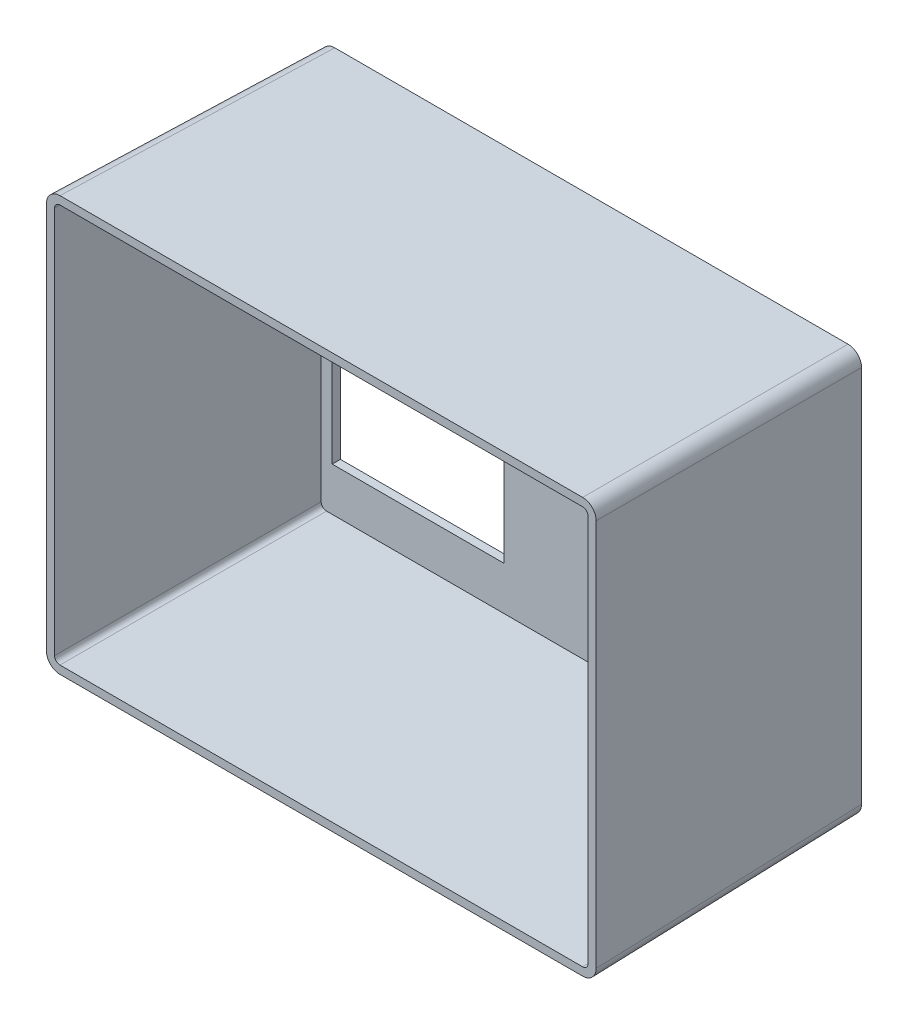
ISO-10303-21;
HEADER;
FILE_DESCRIPTION(('STEP AP214'),'2;1');
FILE_NAME('part.step','',(''),(''),'','','');
FILE_SCHEMA(('AUTOMOTIVE_DESIGN { 1 0 10303 214 1 1 1 1 }'));
ENDSEC;
DATA;
#1=APPLICATION_CONTEXT('core data for automotive mechanical design processes');
#2=APPLICATION_PROTOCOL_DEFINITION('international standard','automotive_design',2000,#1);
#3=PRODUCT_CONTEXT('',#1,'mechanical');
#4=PRODUCT('Part','Part','',(#3));
#5=PRODUCT_RELATED_PRODUCT_CATEGORY('part','',(#4));
#6=PRODUCT_DEFINITION_FORMATION('','',#4);
#7=PRODUCT_DEFINITION_CONTEXT('part definition',#1,'design');
#8=PRODUCT_DEFINITION('design','',#6,#7);
#9=PRODUCT_DEFINITION_SHAPE('','',#8);
#10=(LENGTH_UNIT() NAMED_UNIT(*) SI_UNIT(.MILLI.,.METRE.));
#11=(NAMED_UNIT(*) PLANE_ANGLE_UNIT() SI_UNIT($,.RADIAN.));
#12=(NAMED_UNIT(*) SI_UNIT($,.STERADIAN.) SOLID_ANGLE_UNIT());
#13=UNCERTAINTY_MEASURE_WITH_UNIT(LENGTH_MEASURE(1.E-05),#10,'distance_accuracy_value','');
#14=(GEOMETRIC_REPRESENTATION_CONTEXT(3) GLOBAL_UNCERTAINTY_ASSIGNED_CONTEXT((#13)) GLOBAL_UNIT_ASSIGNED_CONTEXT((#10,
#11,#12)) REPRESENTATION_CONTEXT('',''));
#15=CARTESIAN_POINT('',(0.,0.,0.));
#16=DIRECTION('',(0.,0.,1.));
#17=DIRECTION('',(1.,0.,0.));
#18=AXIS2_PLACEMENT_3D('',#15,#16,#17);
#19=CARTESIAN_POINT('',(71.0730699258488,138.110328622126,0.));
#20=DIRECTION('',(0.999847695156391,0.,-0.0174524064372835));
#21=DIRECTION('',(-0.0174524064372835,0.,-0.999847695156391));
#22=AXIS2_PLACEMENT_3D('',#19,#20,#21);
#23=PLANE('',#22);
#24=DIRECTION('',(0.,-1.,0.));
#25=VECTOR('',#24,1.);
#26=CARTESIAN_POINT('',(72.8185764186705,138.110328622126,100.));
#27=LINE('',#26,#25);
#28=CARTESIAN_POINT('',(72.8185764186706,-8.63593939491358,100.));
#29=VERTEX_POINT('',#28);
#30=CARTESIAN_POINT('',(72.8185764186705,134.856596639166,100.));
#31=VERTEX_POINT('',#30);
#32=EDGE_CURVE('E363',#29,#31,#27,.F.);
#33=ORIENTED_EDGE('',*,*,#32,.F.);
#34=DIRECTION('',(0.0174497491606827,-0.0174497491606827,0.999695459881887));
#35=VECTOR('',#34,1.);
#36=CARTESIAN_POINT('',(71.0289181008327,-6.84628107707569,-2.52945636110152));
#37=LINE('',#36,#35);
#38=CARTESIAN_POINT('',(71.0730699258488,-6.89043290209182,0.));
#39=VERTEX_POINT('',#38);
#40=EDGE_CURVE('E403',#29,#39,#37,.F.);
#41=ORIENTED_EDGE('',*,*,#40,.T.);
#42=DIRECTION('',(0.,1.,0.));
#43=VECTOR('',#42,1.);
#44=CARTESIAN_POINT('',(71.0730699258488,138.110328622126,0.));
#45=LINE('',#44,#43);
#46=CARTESIAN_POINT('',(71.0730699258488,133.111090146344,0.));
#47=VERTEX_POINT('',#46);
#48=EDGE_CURVE('E324',#39,#47,#45,.T.);
#49=ORIENTED_EDGE('',*,*,#48,.T.);
#50=DIRECTION('',(0.0174497491606827,0.0174497491606827,0.999695459881888));
#51=VECTOR('',#50,1.);
#52=CARTESIAN_POINT('',(71.0745921626983,133.112612383194,0.0872088907003298));
#53=LINE('',#52,#51);
#54=EDGE_CURVE('E401',#47,#31,#53,.T.);
#55=ORIENTED_EDGE('',*,*,#54,.T.);
#56=EDGE_LOOP('',(#33,#41,#49,#55));
#57=FACE_BOUND('',#56,.T.);
#58=ADVANCED_FACE('F39',(#57),#23,.T.);
#59=CARTESIAN_POINT('',(-128.926930074151,138.110328622126,0.));
#60=DIRECTION('',(0.,0.999847695156391,-0.0174524064372835));
#61=DIRECTION('',(0.,0.0174524064372835,0.999847695156391));
#62=AXIS2_PLACEMENT_3D('',#59,#60,#61);
#63=PLANE('',#62);
#64=DIRECTION('',(-1.,0.,0.));
#65=VECTOR('',#64,1.);
#66=CARTESIAN_POINT('',(-128.926930074151,138.110328622126,0.));
#67=LINE('',#66,#65);
#68=CARTESIAN_POINT('',(66.0738314500668,138.110328622126,0.));
#69=VERTEX_POINT('',#68);
#70=CARTESIAN_POINT('',(-123.927691598369,138.110328622126,0.));
#71=VERTEX_POINT('',#70);
#72=EDGE_CURVE('E354',#69,#71,#67,.T.);
#73=ORIENTED_EDGE('',*,*,#72,.T.);
#74=DIRECTION('',(-0.0174497491606827,0.0174497491606827,0.999695459881888));
#75=VECTOR('',#74,1.);
#76=CARTESIAN_POINT('',(-123.929213835219,138.111850858976,0.0872088907003298));
#77=LINE('',#76,#75);
#78=CARTESIAN_POINT('',(-125.673198091191,139.855835114948,100.));
#79=VERTEX_POINT('',#78);
#80=EDGE_CURVE('E409',#71,#79,#77,.T.);
#81=ORIENTED_EDGE('',*,*,#80,.T.);
#82=DIRECTION('',(1.,0.,0.));
#83=VECTOR('',#82,1.);
#84=CARTESIAN_POINT('',(-128.926930074151,139.855835114948,100.));
#85=LINE('',#84,#83);
#86=CARTESIAN_POINT('',(67.8193379428886,139.855835114948,100.));
#87=VERTEX_POINT('',#86);
#88=EDGE_CURVE('E366',#87,#79,#85,.F.);
#89=ORIENTED_EDGE('',*,*,#88,.F.);
#90=DIRECTION('',(0.0174497491606827,0.0174497491606827,0.999695459881888));
#91=VECTOR('',#90,1.);
#92=CARTESIAN_POINT('',(66.0144549377621,138.050952109822,-3.40167811170213));
#93=LINE('',#92,#91);
#94=EDGE_CURVE('E406',#87,#69,#93,.F.);
#95=ORIENTED_EDGE('',*,*,#94,.T.);
#96=EDGE_LOOP('',(#73,#81,#89,#95));
#97=FACE_BOUND('',#96,.T.);
#98=ADVANCED_FACE('F453',(#97),#63,.T.);
#99=CARTESIAN_POINT('',(-128.926930074151,138.110328622126,0.));
#100=DIRECTION('',(-0.999847695156391,0.,-0.0174524064372835));
#101=DIRECTION('',(-0.0174524064372835,0.,0.999847695156391));
#102=AXIS2_PLACEMENT_3D('',#99,#100,#101);
#103=PLANE('',#102);
#104=DIRECTION('',(0.,-1.,0.));
#105=VECTOR('',#104,1.);
#106=CARTESIAN_POINT('',(-128.926930074151,138.110328622126,0.));
#107=LINE('',#106,#105);
#108=CARTESIAN_POINT('',(-128.926930074151,133.111090146344,0.));
#109=VERTEX_POINT('',#108);
#110=CARTESIAN_POINT('',(-128.926930074151,-6.89043290209182,0.));
#111=VERTEX_POINT('',#110);
#112=EDGE_CURVE('E357',#109,#111,#107,.T.);
#113=ORIENTED_EDGE('',*,*,#112,.T.);
#114=DIRECTION('',(-0.0174497491606827,-0.0174497491606827,0.999695459881887));
#115=VECTOR('',#114,1.);
#116=CARTESIAN_POINT('',(-128.882778249135,-6.84628107707569,-2.52945636110151));
#117=LINE('',#116,#115);
#118=CARTESIAN_POINT('',(-130.672436566973,-8.63593939491358,100.));
#119=VERTEX_POINT('',#118);
#120=EDGE_CURVE('E391',#111,#119,#117,.T.);
#121=ORIENTED_EDGE('',*,*,#120,.T.);
#122=DIRECTION('',(0.,1.,0.));
#123=VECTOR('',#122,1.);
#124=CARTESIAN_POINT('',(-130.672436566973,138.110328622126,100.));
#125=LINE('',#124,#123);
#126=CARTESIAN_POINT('',(-130.672436566973,134.856596639166,100.));
#127=VERTEX_POINT('',#126);
#128=EDGE_CURVE('E369',#127,#119,#125,.F.);
#129=ORIENTED_EDGE('',*,*,#128,.F.);
#130=DIRECTION('',(-0.0174497491606827,0.0174497491606827,0.999695459881888));
#131=VECTOR('',#130,1.);
#132=CARTESIAN_POINT('',(-128.928452311001,133.112612383194,0.0872088907003298));
#133=LINE('',#132,#131);
#134=EDGE_CURVE('E388',#127,#109,#133,.F.);
#135=ORIENTED_EDGE('',*,*,#134,.T.);
#136=EDGE_LOOP('',(#113,#121,#129,#135));
#137=FACE_BOUND('',#136,.T.);
#138=ADVANCED_FACE('F459',(#137),#103,.T.);
#139=CARTESIAN_POINT('',(-128.926930074151,-11.8896713778738,0.));
#140=DIRECTION('',(0.,-0.999847695156391,-0.0174524064372835));
#141=DIRECTION('',(0.,0.0174524064372836,-0.999847695156391));
#142=AXIS2_PLACEMENT_3D('',#139,#140,#141);
#143=PLANE('',#142);
#144=DIRECTION('',(-1.,0.,0.));
#145=VECTOR('',#144,1.);
#146=CARTESIAN_POINT('',(-128.926930074151,-13.6351778706955,100.));
#147=LINE('',#146,#145);
#148=CARTESIAN_POINT('',(-125.673198091191,-13.6351778706955,100.));
#149=VERTEX_POINT('',#148);
#150=CARTESIAN_POINT('',(67.8193379428886,-13.6351778706955,100.));
#151=VERTEX_POINT('',#150);
#152=EDGE_CURVE('E372',#149,#151,#147,.F.);
#153=ORIENTED_EDGE('',*,*,#152,.F.);
#154=DIRECTION('',(-0.0174497491606827,-0.0174497491606827,0.999695459881888));
#155=VECTOR('',#154,1.);
#156=CARTESIAN_POINT('',(-123.929213835219,-11.8911936147233,0.0872088907003298));
#157=LINE('',#156,#155);
#158=CARTESIAN_POINT('',(-123.927691598369,-11.8896713778738,0.));
#159=VERTEX_POINT('',#158);
#160=EDGE_CURVE('E377',#149,#159,#157,.F.);
#161=ORIENTED_EDGE('',*,*,#160,.T.);
#162=DIRECTION('',(1.,0.,0.));
#163=VECTOR('',#162,1.);
#164=CARTESIAN_POINT('',(-128.926930074151,-11.8896713778738,0.));
#165=LINE('',#164,#163);
#166=CARTESIAN_POINT('',(66.0738314500668,-11.8896713778738,0.));
#167=VERTEX_POINT('',#166);
#168=EDGE_CURVE('E360',#159,#167,#165,.T.);
#169=ORIENTED_EDGE('',*,*,#168,.T.);
#170=DIRECTION('',(0.0174497491606827,-0.0174497491606827,0.999695459881888));
#171=VECTOR('',#170,1.);
#172=CARTESIAN_POINT('',(66.0144549377621,-11.8302948655691,-3.40167811170213));
#173=LINE('',#172,#171);
#174=EDGE_CURVE('E375',#167,#151,#173,.T.);
#175=ORIENTED_EDGE('',*,*,#174,.T.);
#176=EDGE_LOOP('',(#153,#161,#169,#175));
#177=FACE_BOUND('',#176,.T.);
#178=ADVANCED_FACE('F466',(#177),#143,.T.);
#179=CARTESIAN_POINT('',(0.,0.,100.));
#180=DIRECTION('',(0.,0.,1.));
#181=DIRECTION('',(1.,0.,0.));
#182=AXIS2_PLACEMENT_3D('',#179,#180,#181);
#183=PLANE('',#182);
#184=DIRECTION('',(0.,1.,0.));
#185=VECTOR('',#184,1.);
#186=CARTESIAN_POINT('',(-127.671979582841,138.110328622126,100.));
#187=LINE('',#186,#185);
#188=CARTESIAN_POINT('',(-127.671979582841,134.855682740503,100.));
#189=VERTEX_POINT('',#188);
#190=CARTESIAN_POINT('',(-127.671979582841,-8.63502549625103,100.));
#191=VERTEX_POINT('',#190);
#192=EDGE_CURVE('E343',#189,#191,#187,.F.);
#193=ORIENTED_EDGE('',*,*,#192,.F.);
#194=CARTESIAN_POINT('',(-125.671674926753,134.855073474728,100.));
#195=DIRECTION('',(0.,0.,1.));
#196=DIRECTION('',(0.707106781186548,-0.707106781186547,0.));
#197=AXIS2_PLACEMENT_3D('',#194,#195,#196);
#198=ELLIPSE('',#197,2.0006092657821,2.);
#199=CARTESIAN_POINT('',(-125.672284192528,136.855378130816,100.));
#200=VERTEX_POINT('',#199);
#201=EDGE_CURVE('E341',#200,#189,#198,.T.);
#202=ORIENTED_EDGE('',*,*,#201,.F.);
#203=DIRECTION('',(1.,0.,0.));
#204=VECTOR('',#203,1.);
#205=CARTESIAN_POINT('',(-128.926930074151,136.855378130816,100.));
#206=LINE('',#205,#204);
#207=CARTESIAN_POINT('',(67.818424044226,136.855378130816,100.));
#208=VERTEX_POINT('',#207);
#209=EDGE_CURVE('E339',#208,#200,#206,.F.);
#210=ORIENTED_EDGE('',*,*,#209,.F.);
#211=CARTESIAN_POINT('',(67.817814778451,134.855073474728,100.));
#212=DIRECTION('',(0.,0.,1.));
#213=DIRECTION('',(-0.707106781186547,-0.707106781186548,0.));
#214=AXIS2_PLACEMENT_3D('',#211,#212,#213);
#215=ELLIPSE('',#214,2.0006092657821,2.);
#216=CARTESIAN_POINT('',(69.8181194345388,134.855682740503,100.));
#217=VERTEX_POINT('',#216);
#218=EDGE_CURVE('E331',#217,#208,#215,.T.);
#219=ORIENTED_EDGE('',*,*,#218,.F.);
#220=DIRECTION('',(0.,-1.,0.));
#221=VECTOR('',#220,1.);
#222=CARTESIAN_POINT('',(69.8181194345388,138.110328622126,100.));
#223=LINE('',#222,#221);
#224=CARTESIAN_POINT('',(69.8181194345388,-8.63502549625102,100.));
#225=VERTEX_POINT('',#224);
#226=EDGE_CURVE('E305',#225,#217,#223,.F.);
#227=ORIENTED_EDGE('',*,*,#226,.F.);
#228=CARTESIAN_POINT('',(67.817814778451,-8.63441623047599,100.));
#229=DIRECTION('',(0.,0.,1.));
#230=DIRECTION('',(-0.707106781186548,0.707106781186547,0.));
#231=AXIS2_PLACEMENT_3D('',#228,#229,#230);
#232=ELLIPSE('',#231,2.0006092657821,2.);
#233=CARTESIAN_POINT('',(67.818424044226,-10.6347208865638,100.));
#234=VERTEX_POINT('',#233);
#235=EDGE_CURVE('E345',#234,#225,#232,.T.);
#236=ORIENTED_EDGE('',*,*,#235,.F.);
#237=DIRECTION('',(-1.,0.,0.));
#238=VECTOR('',#237,1.);
#239=CARTESIAN_POINT('',(-128.926930074151,-10.6347208865638,100.));
#240=LINE('',#239,#238);
#241=CARTESIAN_POINT('',(-125.672284192528,-10.6347208865638,100.));
#242=VERTEX_POINT('',#241);
#243=EDGE_CURVE('E336',#242,#234,#240,.F.);
#244=ORIENTED_EDGE('',*,*,#243,.F.);
#245=CARTESIAN_POINT('',(-125.671674926753,-8.634416230476,100.));
#246=DIRECTION('',(0.,0.,1.));
#247=DIRECTION('',(0.707106781186547,0.707106781186548,0.));
#248=AXIS2_PLACEMENT_3D('',#245,#246,#247);
#249=ELLIPSE('',#248,2.0006092657821,2.);
#250=EDGE_CURVE('E301',#191,#242,#249,.T.);
#251=ORIENTED_EDGE('',*,*,#250,.F.);
#252=EDGE_LOOP('',(#193,#202,#210,#219,#227,#236,#244,#251));
#253=FACE_BOUND('',#252,.T.);
#254=ORIENTED_EDGE('',*,*,#128,.T.);
#255=CARTESIAN_POINT('',(-125.671674926753,-8.634416230476,100.));
#256=DIRECTION('',(0.,0.,1.));
#257=DIRECTION('',(0.707106781186547,0.707106781186548,0.));
#258=AXIS2_PLACEMENT_3D('',#255,#256,#257);
#259=ELLIPSE('',#258,5.00152316445525,5.);
#260=EDGE_CURVE('E399',#119,#149,#259,.T.);
#261=ORIENTED_EDGE('',*,*,#260,.T.);
#262=ORIENTED_EDGE('',*,*,#152,.T.);
#263=CARTESIAN_POINT('',(67.817814778451,-8.63441623047599,100.));
#264=DIRECTION('',(0.,0.,1.));
#265=DIRECTION('',(-0.707106781186548,0.707106781186547,0.));
#266=AXIS2_PLACEMENT_3D('',#263,#264,#265);
#267=ELLIPSE('',#266,5.00152316445525,5.);
#268=EDGE_CURVE('E397',#151,#29,#267,.T.);
#269=ORIENTED_EDGE('',*,*,#268,.T.);
#270=ORIENTED_EDGE('',*,*,#32,.T.);
#271=CARTESIAN_POINT('',(67.817814778451,134.855073474728,100.));
#272=DIRECTION('',(0.,0.,1.));
#273=DIRECTION('',(-0.707106781186547,-0.707106781186548,0.));
#274=AXIS2_PLACEMENT_3D('',#271,#272,#273);
#275=ELLIPSE('',#274,5.00152316445525,5.);
#276=EDGE_CURVE('E393',#31,#87,#275,.T.);
#277=ORIENTED_EDGE('',*,*,#276,.T.);
#278=ORIENTED_EDGE('',*,*,#88,.T.);
#279=CARTESIAN_POINT('',(-125.671674926753,134.855073474728,100.));
#280=DIRECTION('',(0.,0.,1.));
#281=DIRECTION('',(0.707106781186548,-0.707106781186547,0.));
#282=AXIS2_PLACEMENT_3D('',#279,#280,#281);
#283=ELLIPSE('',#282,5.00152316445525,5.);
#284=EDGE_CURVE('E395',#79,#127,#283,.T.);
#285=ORIENTED_EDGE('',*,*,#284,.T.);
#286=EDGE_LOOP('',(#254,#261,#262,#269,#270,#277,#278,#285));
#287=FACE_BOUND('',#286,.T.);
#288=ADVANCED_FACE('F469',(#253,#287),#183,.T.);
#289=CARTESIAN_POINT('',(0.,0.,0.));
#290=DIRECTION('',(0.,0.,1.));
#291=DIRECTION('',(1.,0.,0.));
#292=AXIS2_PLACEMENT_3D('',#289,#290,#291);
#293=PLANE('',#292);
#294=DIRECTION('',(1.,0.,0.));
#295=VECTOR('',#294,1.);
#296=CARTESIAN_POINT('',(-58.3418365209024,45.3254204708937,0.));
#297=LINE('',#296,#295);
#298=CARTESIAN_POINT('',(-121.841836520902,45.3254204708937,0.));
#299=VERTEX_POINT('',#298);
#300=CARTESIAN_POINT('',(-58.3418365209024,45.3254204708937,0.));
#301=VERTEX_POINT('',#300);
#302=EDGE_CURVE('E235',#299,#301,#297,.T.);
#303=ORIENTED_EDGE('',*,*,#302,.F.);
#304=DIRECTION('',(0.,1.,0.));
#305=VECTOR('',#304,1.);
#306=CARTESIAN_POINT('',(-121.841836520902,45.3254204708937,0.));
#307=LINE('',#306,#305);
#308=CARTESIAN_POINT('',(-121.841836520902,7.22542047089366,0.));
#309=VERTEX_POINT('',#308);
#310=EDGE_CURVE('E54',#309,#299,#307,.T.);
#311=ORIENTED_EDGE('',*,*,#310,.F.);
#312=DIRECTION('',(-1.,0.,0.));
#313=VECTOR('',#312,1.);
#314=CARTESIAN_POINT('',(-58.3418365209024,7.22542047089366,0.));
#315=LINE('',#314,#313);
#316=CARTESIAN_POINT('',(-58.3418365209024,7.22542047089366,0.));
#317=VERTEX_POINT('',#316);
#318=EDGE_CURVE('E242',#317,#309,#315,.T.);
#319=ORIENTED_EDGE('',*,*,#318,.F.);
#320=DIRECTION('',(0.,-1.,0.));
#321=VECTOR('',#320,1.);
#322=CARTESIAN_POINT('',(-58.3418365209024,45.3254204708937,0.));
#323=LINE('',#322,#321);
#324=EDGE_CURVE('E226',#301,#317,#323,.T.);
#325=ORIENTED_EDGE('',*,*,#324,.F.);
#326=EDGE_LOOP('',(#303,#311,#319,#325));
#327=FACE_BOUND('',#326,.T.);
#328=DIRECTION('',(1.,0.,0.));
#329=VECTOR('',#328,1.);
#330=CARTESIAN_POINT('',(51.3314320632622,132.067467355582,0.));
#331=LINE('',#330,#329);
#332=CARTESIAN_POINT('',(31.3314320632622,132.067467355582,0.));
#333=VERTEX_POINT('',#332);
#334=CARTESIAN_POINT('',(51.3314320632622,132.067467355582,0.));
#335=VERTEX_POINT('',#334);
#336=EDGE_CURVE('E254',#333,#335,#331,.T.);
#337=ORIENTED_EDGE('',*,*,#336,.F.);
#338=DIRECTION('',(0.,1.,0.));
#339=VECTOR('',#338,1.);
#340=CARTESIAN_POINT('',(31.3314320632622,132.067467355582,0.));
#341=LINE('',#340,#339);
#342=CARTESIAN_POINT('',(31.3314320632622,106.667467355582,0.));
#343=VERTEX_POINT('',#342);
#344=EDGE_CURVE('E252',#343,#333,#341,.T.);
#345=ORIENTED_EDGE('',*,*,#344,.F.);
#346=DIRECTION('',(-1.,0.,0.));
#347=VECTOR('',#346,1.);
#348=CARTESIAN_POINT('',(51.3314320632622,106.667467355582,0.));
#349=LINE('',#348,#347);
#350=CARTESIAN_POINT('',(51.3314320632622,106.667467355582,0.));
#351=VERTEX_POINT('',#350);
#352=EDGE_CURVE('E261',#351,#343,#349,.T.);
#353=ORIENTED_EDGE('',*,*,#352,.F.);
#354=DIRECTION('',(0.,-1.,0.));
#355=VECTOR('',#354,1.);
#356=CARTESIAN_POINT('',(51.3314320632622,132.067467355582,0.));
#357=LINE('',#356,#355);
#358=EDGE_CURVE('E258',#335,#351,#357,.T.);
#359=ORIENTED_EDGE('',*,*,#358,.F.);
#360=EDGE_LOOP('',(#337,#345,#353,#359));
#361=FACE_BOUND('',#360,.T.);
#362=DIRECTION('',(1.,0.,0.));
#363=VECTOR('',#362,1.);
#364=CARTESIAN_POINT('',(63.8251783273508,17.6722086883321,0.));
#365=LINE('',#364,#363);
#366=CARTESIAN_POINT('',(13.8251783273508,17.6722086883321,0.));
#367=VERTEX_POINT('',#366);
#368=CARTESIAN_POINT('',(63.8251783273508,17.6722086883321,0.));
#369=VERTEX_POINT('',#368);
#370=EDGE_CURVE('E275',#367,#369,#365,.T.);
#371=ORIENTED_EDGE('',*,*,#370,.F.);
#372=DIRECTION('',(0.,1.,0.));
#373=VECTOR('',#372,1.);
#374=CARTESIAN_POINT('',(13.8251783273508,-2.32779131166794,0.));
#375=LINE('',#374,#373);
#376=CARTESIAN_POINT('',(13.8251783273508,-2.32779131166794,0.));
#377=VERTEX_POINT('',#376);
#378=EDGE_CURVE('E249',#377,#367,#375,.T.);
#379=ORIENTED_EDGE('',*,*,#378,.F.);
#380=DIRECTION('',(-1.,0.,0.));
#381=VECTOR('',#380,1.);
#382=CARTESIAN_POINT('',(63.8251783273508,-2.32779131166794,0.));
#383=LINE('',#382,#381);
#384=CARTESIAN_POINT('',(63.8251783273508,-2.32779131166794,0.));
#385=VERTEX_POINT('',#384);
#386=EDGE_CURVE('E281',#385,#377,#383,.T.);
#387=ORIENTED_EDGE('',*,*,#386,.F.);
#388=DIRECTION('',(0.,-1.,0.));
#389=VECTOR('',#388,1.);
#390=CARTESIAN_POINT('',(63.8251783273508,-2.32779131166794,0.));
#391=LINE('',#390,#389);
#392=EDGE_CURVE('E278',#369,#385,#391,.T.);
#393=ORIENTED_EDGE('',*,*,#392,.F.);
#394=EDGE_LOOP('',(#371,#379,#387,#393));
#395=FACE_BOUND('',#394,.T.);
#396=ORIENTED_EDGE('',*,*,#168,.F.);
#397=CARTESIAN_POINT('',(-123.926168433932,-6.88890973765424,0.));
#398=DIRECTION('',(0.,0.,1.));
#399=DIRECTION('',(0.707106781186547,0.707106781186548,0.));
#400=AXIS2_PLACEMENT_3D('',#397,#398,#399);
#401=ELLIPSE('',#400,5.00152316445525,5.);
#402=EDGE_CURVE('E386',#159,#111,#401,.F.);
#403=ORIENTED_EDGE('',*,*,#402,.T.);
#404=ORIENTED_EDGE('',*,*,#112,.F.);
#405=CARTESIAN_POINT('',(-123.926168433932,133.109566981907,0.));
#406=DIRECTION('',(0.,0.,1.));
#407=DIRECTION('',(0.707106781186548,-0.707106781186547,0.));
#408=AXIS2_PLACEMENT_3D('',#405,#406,#407);
#409=ELLIPSE('',#408,5.00152316445525,5.);
#410=EDGE_CURVE('E382',#109,#71,#409,.F.);
#411=ORIENTED_EDGE('',*,*,#410,.T.);
#412=ORIENTED_EDGE('',*,*,#72,.F.);
#413=CARTESIAN_POINT('',(66.0723082856292,133.109566981907,0.));
#414=DIRECTION('',(0.,0.,1.));
#415=DIRECTION('',(-0.707106781186547,-0.707106781186548,0.));
#416=AXIS2_PLACEMENT_3D('',#413,#414,#415);
#417=ELLIPSE('',#416,5.00152316445525,5.);
#418=EDGE_CURVE('E380',#69,#47,#417,.F.);
#419=ORIENTED_EDGE('',*,*,#418,.T.);
#420=ORIENTED_EDGE('',*,*,#48,.F.);
#421=CARTESIAN_POINT('',(66.0723082856293,-6.88890973765423,0.));
#422=DIRECTION('',(0.,0.,1.));
#423=DIRECTION('',(-0.707106781186548,0.707106781186547,0.));
#424=AXIS2_PLACEMENT_3D('',#421,#422,#423);
#425=ELLIPSE('',#424,5.00152316445525,5.);
#426=EDGE_CURVE('E384',#39,#167,#425,.F.);
#427=ORIENTED_EDGE('',*,*,#426,.T.);
#428=EDGE_LOOP('',(#396,#403,#404,#411,#412,#419,#420,#427));
#429=FACE_BOUND('',#428,.T.);
#430=ADVANCED_FACE('F239',(#327,#361,#395,#429),#293,.F.);
#431=CARTESIAN_POINT('',(-123.929213835219,-6.89195513894131,0.174470922886747));
#432=DIRECTION('',(0.0174497491606827,0.0174497491606827,-0.999695459881888));
#433=DIRECTION('',(0.,0.999847695156391,0.0174524064372836));
#434=AXIS2_PLACEMENT_3D('',#431,#432,#433);
#435=CYLINDRICAL_SURFACE('',#434,5.);
#436=ORIENTED_EDGE('',*,*,#260,.F.);
#437=ORIENTED_EDGE('',*,*,#120,.F.);
#438=ORIENTED_EDGE('',*,*,#402,.F.);
#439=ORIENTED_EDGE('',*,*,#160,.F.);
#440=EDGE_LOOP('',(#436,#437,#438,#439));
#441=FACE_BOUND('',#440,.T.);
#442=ADVANCED_FACE('F474',(#441),#435,.T.);
#443=CARTESIAN_POINT('',(66.0296796250507,-6.84628107707569,-2.4421943289151));
#444=DIRECTION('',(-0.0174497491606827,0.0174497491606827,-0.999695459881888));
#445=DIRECTION('',(-0.999847695156391,0.,0.0174524064372836));
#446=AXIS2_PLACEMENT_3D('',#443,#444,#445);
#447=CYLINDRICAL_SURFACE('',#446,5.);
#448=ORIENTED_EDGE('',*,*,#268,.F.);
#449=ORIENTED_EDGE('',*,*,#174,.F.);
#450=ORIENTED_EDGE('',*,*,#426,.F.);
#451=ORIENTED_EDGE('',*,*,#40,.F.);
#452=EDGE_LOOP('',(#448,#449,#450,#451));
#453=FACE_BOUND('',#452,.T.);
#454=ADVANCED_FACE('F477',(#453),#447,.T.);
#455=CARTESIAN_POINT('',(-123.929213835219,133.112612383194,0.174470922886748));
#456=DIRECTION('',(0.0174497491606827,-0.0174497491606827,-0.999695459881887));
#457=DIRECTION('',(-0.999847695156391,0.,-0.0174524064372836));
#458=AXIS2_PLACEMENT_3D('',#455,#456,#457);
#459=CYLINDRICAL_SURFACE('',#458,5.);
#460=ORIENTED_EDGE('',*,*,#284,.F.);
#461=ORIENTED_EDGE('',*,*,#80,.F.);
#462=ORIENTED_EDGE('',*,*,#410,.F.);
#463=ORIENTED_EDGE('',*,*,#134,.F.);
#464=EDGE_LOOP('',(#460,#461,#462,#463));
#465=FACE_BOUND('',#464,.T.);
#466=ADVANCED_FACE('F480',(#465),#459,.T.);
#467=CARTESIAN_POINT('',(66.0144549377621,133.05171363404,-3.31441607951571));
#468=DIRECTION('',(-0.0174497491606827,-0.0174497491606827,-0.999695459881887));
#469=DIRECTION('',(0.,0.999847695156391,-0.0174524064372835));
#470=AXIS2_PLACEMENT_3D('',#467,#468,#469);
#471=CYLINDRICAL_SURFACE('',#470,5.);
#472=ORIENTED_EDGE('',*,*,#276,.F.);
#473=ORIENTED_EDGE('',*,*,#54,.F.);
#474=ORIENTED_EDGE('',*,*,#418,.F.);
#475=ORIENTED_EDGE('',*,*,#94,.F.);
#476=EDGE_LOOP('',(#472,#473,#474,#475));
#477=FACE_BOUND('',#476,.T.);
#478=ADVANCED_FACE('F41',(#477),#471,.T.);
#479=CARTESIAN_POINT('',(68.0735268403796,138.110328622126,0.0523572193118506));
#480=DIRECTION('',(0.999847695156391,0.,-0.0174524064372835));
#481=DIRECTION('',(-0.0174524064372835,0.,-0.999847695156391));
#482=AXIS2_PLACEMENT_3D('',#479,#480,#481);
#483=PLANE('',#482);
#484=ORIENTED_EDGE('',*,*,#226,.T.);
#485=DIRECTION('',(-0.0174497491606827,-0.0174497491606827,-0.999695459881887));
#486=VECTOR('',#485,1.);
#487=CARTESIAN_POINT('',(68.0141503280749,133.05171363404,-3.34932089239028));
#488=LINE('',#487,#486);
#489=CARTESIAN_POINT('',(68.1249781365017,133.162541442466,3.));
#490=VERTEX_POINT('',#489);
#491=EDGE_CURVE('E296',#490,#217,#488,.F.);
#492=ORIENTED_EDGE('',*,*,#491,.F.);
#493=DIRECTION('',(0.,-1.,0.));
#494=VECTOR('',#493,1.);
#495=CARTESIAN_POINT('',(68.1249781365017,138.110328622126,3.));
#496=LINE('',#495,#494);
#497=CARTESIAN_POINT('',(68.1249781365017,-6.94188419821391,3.));
#498=VERTEX_POINT('',#497);
#499=EDGE_CURVE('E267',#498,#490,#496,.F.);
#500=ORIENTED_EDGE('',*,*,#499,.F.);
#501=DIRECTION('',(-0.0174497491606827,0.0174497491606827,-0.999695459881888));
#502=VECTOR('',#501,1.);
#503=CARTESIAN_POINT('',(68.0293750153635,-6.84628107707569,-2.47709914178966));
#504=LINE('',#503,#502);
#505=EDGE_CURVE('E292',#225,#498,#504,.T.);
#506=ORIENTED_EDGE('',*,*,#505,.F.);
#507=EDGE_LOOP('',(#484,#492,#500,#506));
#508=FACE_BOUND('',#507,.T.);
#509=ADVANCED_FACE('F487',(#508),#483,.F.);
#510=CARTESIAN_POINT('',(-128.926930074151,135.110785536657,0.0523572193118506));
#511=DIRECTION('',(0.,0.999847695156391,-0.0174524064372835));
#512=DIRECTION('',(0.,0.0174524064372835,0.999847695156391));
#513=AXIS2_PLACEMENT_3D('',#510,#511,#512);
#514=PLANE('',#513);
#515=DIRECTION('',(1.,0.,0.));
#516=VECTOR('',#515,1.);
#517=CARTESIAN_POINT('',(-128.926930074151,135.162236832779,3.));
#518=LINE('',#517,#516);
#519=CARTESIAN_POINT('',(66.1252827461889,135.162236832779,3.));
#520=VERTEX_POINT('',#519);
#521=CARTESIAN_POINT('',(-123.979142894491,135.162236832779,3.));
#522=VERTEX_POINT('',#521);
#523=EDGE_CURVE('E299',#520,#522,#518,.F.);
#524=ORIENTED_EDGE('',*,*,#523,.F.);
#525=DIRECTION('',(-0.0174497491606827,-0.0174497491606827,-0.999695459881887));
#526=VECTOR('',#525,1.);
#527=CARTESIAN_POINT('',(66.0144549377621,135.051409024352,-3.34932089239028));
#528=LINE('',#527,#526);
#529=EDGE_CURVE('E295',#208,#520,#528,.T.);
#530=ORIENTED_EDGE('',*,*,#529,.F.);
#531=ORIENTED_EDGE('',*,*,#209,.T.);
#532=DIRECTION('',(0.0174497491606827,-0.0174497491606827,-0.999695459881887));
#533=VECTOR('',#532,1.);
#534=CARTESIAN_POINT('',(-123.929213835219,135.112307773507,0.13956611001218));
#535=LINE('',#534,#533);
#536=EDGE_CURVE('E321',#522,#200,#535,.F.);
#537=ORIENTED_EDGE('',*,*,#536,.F.);
#538=EDGE_LOOP('',(#524,#530,#531,#537));
#539=FACE_BOUND('',#538,.T.);
#540=ADVANCED_FACE('F545',(#539),#514,.F.);
#541=CARTESIAN_POINT('',(-125.927386988682,138.110328622126,0.0523572193118506));
#542=DIRECTION('',(-0.999847695156391,0.,-0.0174524064372835));
#543=DIRECTION('',(-0.0174524064372835,0.,0.999847695156391));
#544=AXIS2_PLACEMENT_3D('',#541,#542,#543);
#545=PLANE('',#544);
#546=DIRECTION('',(0.,1.,0.));
#547=VECTOR('',#546,1.);
#548=CARTESIAN_POINT('',(-125.978838284804,138.110328622126,3.));
#549=LINE('',#548,#547);
#550=CARTESIAN_POINT('',(-125.978838284804,133.162541442466,3.));
#551=VERTEX_POINT('',#550);
#552=CARTESIAN_POINT('',(-125.978838284804,-6.94188419821392,3.));
#553=VERTEX_POINT('',#552);
#554=EDGE_CURVE('E306',#551,#553,#549,.F.);
#555=ORIENTED_EDGE('',*,*,#554,.F.);
#556=DIRECTION('',(0.0174497491606827,-0.0174497491606827,-0.999695459881887));
#557=VECTOR('',#556,1.);
#558=CARTESIAN_POINT('',(-125.928909225532,133.112612383194,0.139566110012181));
#559=LINE('',#558,#557);
#560=EDGE_CURVE('E309',#189,#551,#559,.T.);
#561=ORIENTED_EDGE('',*,*,#560,.F.);
#562=ORIENTED_EDGE('',*,*,#192,.T.);
#563=DIRECTION('',(0.0174497491606827,0.0174497491606827,-0.999695459881888));
#564=VECTOR('',#563,1.);
#565=CARTESIAN_POINT('',(-125.928909225531,-6.89195513894131,0.13956611001218));
#566=LINE('',#565,#564);
#567=EDGE_CURVE('E329',#553,#191,#566,.F.);
#568=ORIENTED_EDGE('',*,*,#567,.F.);
#569=EDGE_LOOP('',(#555,#561,#562,#568));
#570=FACE_BOUND('',#569,.T.);
#571=ADVANCED_FACE('F541',(#570),#545,.F.);
#572=CARTESIAN_POINT('',(-128.926930074151,-8.8901282924046,0.0523572193118506));
#573=DIRECTION('',(0.,-0.999847695156391,-0.0174524064372835));
#574=DIRECTION('',(0.,0.0174524064372836,-0.999847695156391));
#575=AXIS2_PLACEMENT_3D('',#572,#573,#574);
#576=PLANE('',#575);
#577=ORIENTED_EDGE('',*,*,#243,.T.);
#578=DIRECTION('',(-0.0174497491606827,0.0174497491606827,-0.999695459881888));
#579=VECTOR('',#578,1.);
#580=CARTESIAN_POINT('',(66.0296796250507,-8.84597646738847,-2.47709914178966));
#581=LINE('',#580,#579);
#582=CARTESIAN_POINT('',(66.1252827461889,-8.9415795885267,3.));
#583=VERTEX_POINT('',#582);
#584=EDGE_CURVE('E334',#583,#234,#581,.F.);
#585=ORIENTED_EDGE('',*,*,#584,.F.);
#586=DIRECTION('',(-1.,0.,0.));
#587=VECTOR('',#586,1.);
#588=CARTESIAN_POINT('',(-128.926930074151,-8.94157958852671,3.));
#589=LINE('',#588,#587);
#590=CARTESIAN_POINT('',(-123.979142894491,-8.94157958852671,3.));
#591=VERTEX_POINT('',#590);
#592=EDGE_CURVE('E302',#591,#583,#589,.F.);
#593=ORIENTED_EDGE('',*,*,#592,.F.);
#594=DIRECTION('',(0.0174497491606827,0.0174497491606827,-0.999695459881888));
#595=VECTOR('',#594,1.);
#596=CARTESIAN_POINT('',(-123.929213835219,-8.8916505292541,0.13956611001218));
#597=LINE('',#596,#595);
#598=EDGE_CURVE('E319',#242,#591,#597,.T.);
#599=ORIENTED_EDGE('',*,*,#598,.F.);
#600=EDGE_LOOP('',(#577,#585,#593,#599));
#601=FACE_BOUND('',#600,.T.);
#602=ADVANCED_FACE('F538',(#601),#576,.F.);
#603=CARTESIAN_POINT('',(0.,0.,3.));
#604=DIRECTION('',(0.,0.,1.));
#605=DIRECTION('',(1.,0.,0.));
#606=AXIS2_PLACEMENT_3D('',#603,#604,#605);
#607=PLANE('',#606);
#608=DIRECTION('',(0.,-1.,0.));
#609=VECTOR('',#608,1.);
#610=CARTESIAN_POINT('',(-121.894201715687,0.,3.));
#611=LINE('',#610,#609);
#612=CARTESIAN_POINT('',(-121.894201715687,45.3777856656783,3.));
#613=VERTEX_POINT('',#612);
#614=CARTESIAN_POINT('',(-121.894201715687,7.17305527610901,3.));
#615=VERTEX_POINT('',#614);
#616=EDGE_CURVE('E11',#613,#615,#611,.T.);
#617=ORIENTED_EDGE('',*,*,#616,.F.);
#618=DIRECTION('',(-1.,0.,0.));
#619=VECTOR('',#618,1.);
#620=CARTESIAN_POINT('',(0.,45.3777856656783,3.));
#621=LINE('',#620,#619);
#622=CARTESIAN_POINT('',(-58.2894713261178,45.3777856656783,3.));
#623=VERTEX_POINT('',#622);
#624=EDGE_CURVE('E429',#623,#613,#621,.T.);
#625=ORIENTED_EDGE('',*,*,#624,.F.);
#626=DIRECTION('',(0.,1.,0.));
#627=VECTOR('',#626,1.);
#628=CARTESIAN_POINT('',(-58.2894713261178,0.,3.));
#629=LINE('',#628,#627);
#630=CARTESIAN_POINT('',(-58.2894713261178,7.17305527610902,3.));
#631=VERTEX_POINT('',#630);
#632=EDGE_CURVE('E229',#631,#623,#629,.T.);
#633=ORIENTED_EDGE('',*,*,#632,.F.);
#634=DIRECTION('',(1.,0.,0.));
#635=VECTOR('',#634,1.);
#636=CARTESIAN_POINT('',(0.,7.17305527610901,3.));
#637=LINE('',#636,#635);
#638=EDGE_CURVE('E47',#615,#631,#637,.T.);
#639=ORIENTED_EDGE('',*,*,#638,.F.);
#640=EDGE_LOOP('',(#617,#625,#633,#639));
#641=FACE_BOUND('',#640,.T.);
#642=DIRECTION('',(0.,-1.,0.));
#643=VECTOR('',#642,1.);
#644=CARTESIAN_POINT('',(31.2790668684776,0.,3.));
#645=LINE('',#644,#643);
#646=CARTESIAN_POINT('',(31.2790668684776,132.119832550366,3.));
#647=VERTEX_POINT('',#646);
#648=CARTESIAN_POINT('',(31.2790668684776,106.615102160797,3.));
#649=VERTEX_POINT('',#648);
#650=EDGE_CURVE('E427',#647,#649,#645,.T.);
#651=ORIENTED_EDGE('',*,*,#650,.F.);
#652=DIRECTION('',(-1.,0.,0.));
#653=VECTOR('',#652,1.);
#654=CARTESIAN_POINT('',(0.,132.119832550366,3.));
#655=LINE('',#654,#653);
#656=CARTESIAN_POINT('',(51.3837972580469,132.119832550366,3.));
#657=VERTEX_POINT('',#656);
#658=EDGE_CURVE('E420',#657,#647,#655,.T.);
#659=ORIENTED_EDGE('',*,*,#658,.F.);
#660=DIRECTION('',(0.,1.,0.));
#661=VECTOR('',#660,1.);
#662=CARTESIAN_POINT('',(51.3837972580469,0.,3.));
#663=LINE('',#662,#661);
#664=CARTESIAN_POINT('',(51.3837972580469,106.615102160797,3.));
#665=VERTEX_POINT('',#664);
#666=EDGE_CURVE('E422',#665,#657,#663,.T.);
#667=ORIENTED_EDGE('',*,*,#666,.F.);
#668=DIRECTION('',(1.,0.,0.));
#669=VECTOR('',#668,1.);
#670=CARTESIAN_POINT('',(0.,106.615102160797,3.));
#671=LINE('',#670,#669);
#672=EDGE_CURVE('E425',#649,#665,#671,.T.);
#673=ORIENTED_EDGE('',*,*,#672,.F.);
#674=EDGE_LOOP('',(#651,#659,#667,#673));
#675=FACE_BOUND('',#674,.T.);
#676=DIRECTION('',(0.,-1.,0.));
#677=VECTOR('',#676,1.);
#678=CARTESIAN_POINT('',(13.7728131325661,0.,3.));
#679=LINE('',#678,#677);
#680=CARTESIAN_POINT('',(13.7728131325661,17.7245738831167,3.));
#681=VERTEX_POINT('',#680);
#682=CARTESIAN_POINT('',(13.7728131325661,-2.38015650645259,3.));
#683=VERTEX_POINT('',#682);
#684=EDGE_CURVE('E418',#681,#683,#679,.T.);
#685=ORIENTED_EDGE('',*,*,#684,.F.);
#686=DIRECTION('',(-1.,0.,0.));
#687=VECTOR('',#686,1.);
#688=CARTESIAN_POINT('',(0.,17.7245738831167,3.));
#689=LINE('',#688,#687);
#690=CARTESIAN_POINT('',(63.8775435221354,17.7245738831167,3.));
#691=VERTEX_POINT('',#690);
#692=EDGE_CURVE('E411',#691,#681,#689,.T.);
#693=ORIENTED_EDGE('',*,*,#692,.F.);
#694=DIRECTION('',(0.,1.,0.));
#695=VECTOR('',#694,1.);
#696=CARTESIAN_POINT('',(63.8775435221354,0.,3.));
#697=LINE('',#696,#695);
#698=CARTESIAN_POINT('',(63.8775435221354,-2.38015650645259,3.));
#699=VERTEX_POINT('',#698);
#700=EDGE_CURVE('E413',#699,#691,#697,.T.);
#701=ORIENTED_EDGE('',*,*,#700,.F.);
#702=DIRECTION('',(1.,0.,0.));
#703=VECTOR('',#702,1.);
#704=CARTESIAN_POINT('',(0.,-2.38015650645259,3.));
#705=LINE('',#704,#703);
#706=EDGE_CURVE('E416',#683,#699,#705,.T.);
#707=ORIENTED_EDGE('',*,*,#706,.F.);
#708=EDGE_LOOP('',(#685,#693,#701,#707));
#709=FACE_BOUND('',#708,.T.);
#710=ORIENTED_EDGE('',*,*,#592,.T.);
#711=CARTESIAN_POINT('',(66.1246734804139,-6.94127493243888,3.));
#712=DIRECTION('',(0.,0.,1.));
#713=DIRECTION('',(-0.707106781186548,0.707106781186547,0.));
#714=AXIS2_PLACEMENT_3D('',#711,#712,#713);
#715=ELLIPSE('',#714,2.0006092657821,2.);
#716=EDGE_CURVE('E310',#498,#583,#715,.F.);
#717=ORIENTED_EDGE('',*,*,#716,.F.);
#718=ORIENTED_EDGE('',*,*,#499,.T.);
#719=CARTESIAN_POINT('',(66.1246734804139,133.161932176691,3.));
#720=DIRECTION('',(0.,0.,1.));
#721=DIRECTION('',(-0.707106781186547,-0.707106781186548,0.));
#722=AXIS2_PLACEMENT_3D('',#719,#720,#721);
#723=ELLIPSE('',#722,2.0006092657821,2.);
#724=EDGE_CURVE('E315',#520,#490,#723,.F.);
#725=ORIENTED_EDGE('',*,*,#724,.F.);
#726=ORIENTED_EDGE('',*,*,#523,.T.);
#727=CARTESIAN_POINT('',(-123.978533628716,133.161932176691,3.));
#728=DIRECTION('',(0.,0.,1.));
#729=DIRECTION('',(0.707106781186548,-0.707106781186547,0.));
#730=AXIS2_PLACEMENT_3D('',#727,#728,#729);
#731=ELLIPSE('',#730,2.0006092657821,2.);
#732=EDGE_CURVE('E313',#551,#522,#731,.F.);
#733=ORIENTED_EDGE('',*,*,#732,.F.);
#734=ORIENTED_EDGE('',*,*,#554,.T.);
#735=CARTESIAN_POINT('',(-123.978533628716,-6.94127493243889,3.));
#736=DIRECTION('',(0.,0.,1.));
#737=DIRECTION('',(0.707106781186547,0.707106781186548,0.));
#738=AXIS2_PLACEMENT_3D('',#735,#736,#737);
#739=ELLIPSE('',#738,2.0006092657821,2.);
#740=EDGE_CURVE('E307',#591,#553,#739,.F.);
#741=ORIENTED_EDGE('',*,*,#740,.F.);
#742=EDGE_LOOP('',(#710,#717,#718,#725,#726,#733,#734,#741));
#743=FACE_BOUND('',#742,.T.);
#744=ADVANCED_FACE('F437',(#641,#675,#709,#743),#607,.T.);
#745=CARTESIAN_POINT('',(-123.929213835219,-6.89195513894131,0.174470922886747));
#746=DIRECTION('',(0.0174497491606827,0.0174497491606827,-0.999695459881888));
#747=DIRECTION('',(0.,0.999847695156391,0.0174524064372836));
#748=AXIS2_PLACEMENT_3D('',#745,#746,#747);
#749=CYLINDRICAL_SURFACE('',#748,2.);
#750=ORIENTED_EDGE('',*,*,#250,.T.);
#751=ORIENTED_EDGE('',*,*,#598,.T.);
#752=ORIENTED_EDGE('',*,*,#740,.T.);
#753=ORIENTED_EDGE('',*,*,#567,.T.);
#754=EDGE_LOOP('',(#750,#751,#752,#753));
#755=FACE_BOUND('',#754,.T.);
#756=ADVANCED_FACE('F531',(#755),#749,.F.);
#757=CARTESIAN_POINT('',(66.0296796250507,-6.84628107707569,-2.4421943289151));
#758=DIRECTION('',(-0.0174497491606827,0.0174497491606827,-0.999695459881888));
#759=DIRECTION('',(-0.999847695156391,0.,0.0174524064372836));
#760=AXIS2_PLACEMENT_3D('',#757,#758,#759);
#761=CYLINDRICAL_SURFACE('',#760,2.);
#762=ORIENTED_EDGE('',*,*,#235,.T.);
#763=ORIENTED_EDGE('',*,*,#505,.T.);
#764=ORIENTED_EDGE('',*,*,#716,.T.);
#765=ORIENTED_EDGE('',*,*,#584,.T.);
#766=EDGE_LOOP('',(#762,#763,#764,#765));
#767=FACE_BOUND('',#766,.T.);
#768=ADVANCED_FACE('F527',(#767),#761,.F.);
#769=CARTESIAN_POINT('',(-123.929213835219,133.112612383194,0.174470922886748));
#770=DIRECTION('',(0.0174497491606827,-0.0174497491606827,-0.999695459881887));
#771=DIRECTION('',(-0.999847695156391,0.,-0.0174524064372836));
#772=AXIS2_PLACEMENT_3D('',#769,#770,#771);
#773=CYLINDRICAL_SURFACE('',#772,2.);
#774=ORIENTED_EDGE('',*,*,#201,.T.);
#775=ORIENTED_EDGE('',*,*,#560,.T.);
#776=ORIENTED_EDGE('',*,*,#732,.T.);
#777=ORIENTED_EDGE('',*,*,#536,.T.);
#778=EDGE_LOOP('',(#774,#775,#776,#777));
#779=FACE_BOUND('',#778,.T.);
#780=ADVANCED_FACE('F523',(#779),#773,.F.);
#781=CARTESIAN_POINT('',(66.0144549377621,133.05171363404,-3.31441607951571));
#782=DIRECTION('',(-0.0174497491606827,-0.0174497491606827,-0.999695459881887));
#783=DIRECTION('',(0.,0.999847695156391,-0.0174524064372835));
#784=AXIS2_PLACEMENT_3D('',#781,#782,#783);
#785=CYLINDRICAL_SURFACE('',#784,2.);
#786=ORIENTED_EDGE('',*,*,#218,.T.);
#787=ORIENTED_EDGE('',*,*,#529,.T.);
#788=ORIENTED_EDGE('',*,*,#724,.T.);
#789=ORIENTED_EDGE('',*,*,#491,.T.);
#790=EDGE_LOOP('',(#786,#787,#788,#789));
#791=FACE_BOUND('',#790,.T.);
#792=ADVANCED_FACE('F519',(#791),#785,.F.);
#793=CARTESIAN_POINT('',(13.8251783273508,-2.32779131166794,0.));
#794=DIRECTION('',(-0.999847695156391,0.,-0.0174524064372835));
#795=DIRECTION('',(-0.0174524064372835,0.,0.999847695156391));
#796=AXIS2_PLACEMENT_3D('',#793,#794,#795);
#797=PLANE('',#796);
#798=ORIENTED_EDGE('',*,*,#684,.T.);
#799=DIRECTION('',(0.0174497491606827,0.0174497491606827,-0.999695459881887));
#800=VECTOR('',#799,1.);
#801=CARTESIAN_POINT('',(13.8404030146393,-2.3125666243794,-0.872221750600615));
#802=LINE('',#801,#800);
#803=EDGE_CURVE('E255',#683,#377,#802,.T.);
#804=ORIENTED_EDGE('',*,*,#803,.T.);
#805=ORIENTED_EDGE('',*,*,#378,.T.);
#806=DIRECTION('',(0.0174497491606827,-0.0174497491606827,-0.999695459881887));
#807=VECTOR('',#806,1.);
#808=CARTESIAN_POINT('',(13.8312682022662,17.6661188134167,-0.348888700240246));
#809=LINE('',#808,#807);
#810=EDGE_CURVE('E284',#681,#367,#809,.T.);
#811=ORIENTED_EDGE('',*,*,#810,.F.);
#812=EDGE_LOOP('',(#798,#804,#805,#811));
#813=FACE_BOUND('',#812,.T.);
#814=ADVANCED_FACE('F522',(#813),#797,.F.);
#815=CARTESIAN_POINT('',(63.8251783273508,-2.32779131166794,0.));
#816=DIRECTION('',(0.,-0.999847695156391,-0.0174524064372835));
#817=DIRECTION('',(0.,0.0174524064372835,-0.999847695156391));
#818=AXIS2_PLACEMENT_3D('',#815,#816,#817);
#819=PLANE('',#818);
#820=ORIENTED_EDGE('',*,*,#706,.T.);
#821=DIRECTION('',(-0.0174497491606827,0.0174497491606827,-0.999695459881887));
#822=VECTOR('',#821,1.);
#823=CARTESIAN_POINT('',(63.8251783273508,-2.32779131166794,0.));
#824=LINE('',#823,#822);
#825=EDGE_CURVE('E286',#699,#385,#824,.T.);
#826=ORIENTED_EDGE('',*,*,#825,.T.);
#827=ORIENTED_EDGE('',*,*,#386,.T.);
#828=ORIENTED_EDGE('',*,*,#803,.F.);
#829=EDGE_LOOP('',(#820,#826,#827,#828));
#830=FACE_BOUND('',#829,.T.);
#831=ADVANCED_FACE('F553',(#830),#819,.F.);
#832=CARTESIAN_POINT('',(63.8251783273508,-2.32779131166794,0.));
#833=DIRECTION('',(0.999847695156391,0.,-0.0174524064372835));
#834=DIRECTION('',(-0.0174524064372835,0.,-0.999847695156391));
#835=AXIS2_PLACEMENT_3D('',#832,#833,#834);
#836=PLANE('',#835);
#837=ORIENTED_EDGE('',*,*,#700,.T.);
#838=DIRECTION('',(-0.0174497491606827,-0.0174497491606827,-0.999695459881887));
#839=VECTOR('',#838,1.);
#840=CARTESIAN_POINT('',(63.8251783273508,17.6722086883321,0.));
#841=LINE('',#840,#839);
#842=EDGE_CURVE('E289',#691,#369,#841,.T.);
#843=ORIENTED_EDGE('',*,*,#842,.T.);
#844=ORIENTED_EDGE('',*,*,#392,.T.);
#845=ORIENTED_EDGE('',*,*,#825,.F.);
#846=EDGE_LOOP('',(#837,#843,#844,#845));
#847=FACE_BOUND('',#846,.T.);
#848=ADVANCED_FACE('F556',(#847),#836,.F.);
#849=CARTESIAN_POINT('',(63.8251783273508,17.6722086883321,0.));
#850=DIRECTION('',(0.,0.999847695156391,-0.0174524064372835));
#851=DIRECTION('',(0.,0.0174524064372835,0.999847695156391));
#852=AXIS2_PLACEMENT_3D('',#849,#850,#851);
#853=PLANE('',#852);
#854=ORIENTED_EDGE('',*,*,#692,.T.);
#855=ORIENTED_EDGE('',*,*,#810,.T.);
#856=ORIENTED_EDGE('',*,*,#370,.T.);
#857=ORIENTED_EDGE('',*,*,#842,.F.);
#858=EDGE_LOOP('',(#854,#855,#856,#857));
#859=FACE_BOUND('',#858,.T.);
#860=ADVANCED_FACE('F560',(#859),#853,.F.);
#861=CARTESIAN_POINT('',(31.3314320632622,132.067467355582,0.));
#862=DIRECTION('',(-0.999847695156391,0.,-0.0174524064372835));
#863=DIRECTION('',(-0.0174524064372835,0.,0.999847695156391));
#864=AXIS2_PLACEMENT_3D('',#861,#862,#863);
#865=PLANE('',#864);
#866=ORIENTED_EDGE('',*,*,#650,.T.);
#867=DIRECTION('',(0.0174497491606827,0.0174497491606827,-0.999695459881887));
#868=VECTOR('',#867,1.);
#869=CARTESIAN_POINT('',(31.3375219381776,106.673557230497,-0.348888700240246));
#870=LINE('',#869,#868);
#871=EDGE_CURVE('E265',#649,#343,#870,.T.);
#872=ORIENTED_EDGE('',*,*,#871,.T.);
#873=ORIENTED_EDGE('',*,*,#344,.T.);
#874=DIRECTION('',(0.0174497491606827,-0.0174497491606827,-0.999695459881887));
#875=VECTOR('',#874,1.);
#876=CARTESIAN_POINT('',(31.3314320632622,132.067467355582,0.));
#877=LINE('',#876,#875);
#878=EDGE_CURVE('E264',#647,#333,#877,.T.);
#879=ORIENTED_EDGE('',*,*,#878,.F.);
#880=EDGE_LOOP('',(#866,#872,#873,#879));
#881=FACE_BOUND('',#880,.T.);
#882=ADVANCED_FACE('F564',(#881),#865,.F.);
#883=CARTESIAN_POINT('',(51.3314320632622,106.667467355582,0.));
#884=DIRECTION('',(0.,-0.999847695156391,-0.0174524064372835));
#885=DIRECTION('',(0.,0.0174524064372835,-0.999847695156391));
#886=AXIS2_PLACEMENT_3D('',#883,#884,#885);
#887=PLANE('',#886);
#888=ORIENTED_EDGE('',*,*,#672,.T.);
#889=DIRECTION('',(-0.0174497491606827,0.0174497491606827,-0.999695459881887));
#890=VECTOR('',#889,1.);
#891=CARTESIAN_POINT('',(51.3236979221197,106.675201496724,-0.443088649305112));
#892=LINE('',#891,#890);
#893=EDGE_CURVE('E268',#665,#351,#892,.T.);
#894=ORIENTED_EDGE('',*,*,#893,.T.);
#895=ORIENTED_EDGE('',*,*,#352,.T.);
#896=ORIENTED_EDGE('',*,*,#871,.F.);
#897=EDGE_LOOP('',(#888,#894,#895,#896));
#898=FACE_BOUND('',#897,.T.);
#899=ADVANCED_FACE('F569',(#898),#887,.F.);
#900=CARTESIAN_POINT('',(51.3314320632622,132.067467355582,0.));
#901=DIRECTION('',(0.999847695156391,0.,-0.0174524064372835));
#902=DIRECTION('',(-0.0174524064372835,0.,-0.999847695156391));
#903=AXIS2_PLACEMENT_3D('',#900,#901,#902);
#904=PLANE('',#903);
#905=ORIENTED_EDGE('',*,*,#666,.T.);
#906=DIRECTION('',(-0.0174497491606827,-0.0174497491606827,-0.999695459881887));
#907=VECTOR('',#906,1.);
#908=CARTESIAN_POINT('',(51.3314320632622,132.067467355582,0.));
#909=LINE('',#908,#907);
#910=EDGE_CURVE('E271',#657,#335,#909,.T.);
#911=ORIENTED_EDGE('',*,*,#910,.T.);
#912=ORIENTED_EDGE('',*,*,#358,.T.);
#913=ORIENTED_EDGE('',*,*,#893,.F.);
#914=EDGE_LOOP('',(#905,#911,#912,#913));
#915=FACE_BOUND('',#914,.T.);
#916=ADVANCED_FACE('F448',(#915),#904,.F.);
#917=CARTESIAN_POINT('',(51.3314320632622,132.067467355582,0.));
#918=DIRECTION('',(0.,0.999847695156391,-0.0174524064372835));
#919=DIRECTION('',(0.,0.0174524064372835,0.999847695156391));
#920=AXIS2_PLACEMENT_3D('',#917,#918,#919);
#921=PLANE('',#920);
#922=ORIENTED_EDGE('',*,*,#658,.T.);
#923=ORIENTED_EDGE('',*,*,#878,.T.);
#924=ORIENTED_EDGE('',*,*,#336,.T.);
#925=ORIENTED_EDGE('',*,*,#910,.F.);
#926=EDGE_LOOP('',(#922,#923,#924,#925));
#927=FACE_BOUND('',#926,.T.);
#928=ADVANCED_FACE('F441',(#927),#921,.F.);
#929=CARTESIAN_POINT('',(-121.841836520902,45.3254204708937,0.));
#930=DIRECTION('',(-0.999847695156391,0.,-0.0174524064372835));
#931=DIRECTION('',(-0.0174524064372835,0.,0.999847695156391));
#932=AXIS2_PLACEMENT_3D('',#929,#930,#931);
#933=PLANE('',#932);
#934=ORIENTED_EDGE('',*,*,#616,.T.);
#935=DIRECTION('',(0.0174497491606827,0.0174497491606827,-0.999695459881887));
#936=VECTOR('',#935,1.);
#937=CARTESIAN_POINT('',(-121.822501168046,7.24475582375011,-1.10772162326278));
#938=LINE('',#937,#936);
#939=EDGE_CURVE('E247',#615,#309,#938,.T.);
#940=ORIENTED_EDGE('',*,*,#939,.T.);
#941=ORIENTED_EDGE('',*,*,#310,.T.);
#942=DIRECTION('',(0.0174497491606827,-0.0174497491606827,-0.999695459881887));
#943=VECTOR('',#942,1.);
#944=CARTESIAN_POINT('',(-121.841836520902,45.3254204708937,0.));
#945=LINE('',#944,#943);
#946=EDGE_CURVE('E232',#613,#299,#945,.T.);
#947=ORIENTED_EDGE('',*,*,#946,.F.);
#948=EDGE_LOOP('',(#934,#940,#941,#947));
#949=FACE_BOUND('',#948,.T.);
#950=ADVANCED_FACE('F439',(#949),#933,.F.);
#951=CARTESIAN_POINT('',(-58.3418365209024,7.22542047089366,0.));
#952=DIRECTION('',(0.,-0.999847695156391,-0.0174524064372835));
#953=DIRECTION('',(0.,0.0174524064372835,-0.999847695156391));
#954=AXIS2_PLACEMENT_3D('',#951,#952,#953);
#955=PLANE('',#954);
#956=ORIENTED_EDGE('',*,*,#638,.T.);
#957=DIRECTION('',(-0.0174497491606827,0.0174497491606827,-0.999695459881887));
#958=VECTOR('',#957,1.);
#959=CARTESIAN_POINT('',(-58.3534377326163,7.23702168260754,-0.664632973957668));
#960=LINE('',#959,#958);
#961=EDGE_CURVE('E231',#631,#317,#960,.T.);
#962=ORIENTED_EDGE('',*,*,#961,.T.);
#963=ORIENTED_EDGE('',*,*,#318,.T.);
#964=ORIENTED_EDGE('',*,*,#939,.F.);
#965=EDGE_LOOP('',(#956,#962,#963,#964));
#966=FACE_BOUND('',#965,.T.);
#967=ADVANCED_FACE('F434',(#966),#955,.F.);
#968=CARTESIAN_POINT('',(-58.3418365209024,45.3254204708937,0.));
#969=DIRECTION('',(0.999847695156391,0.,-0.0174524064372835));
#970=DIRECTION('',(-0.0174524064372835,0.,-0.999847695156391));
#971=AXIS2_PLACEMENT_3D('',#968,#969,#970);
#972=PLANE('',#971);
#973=ORIENTED_EDGE('',*,*,#632,.T.);
#974=DIRECTION('',(-0.0174497491606827,-0.0174497491606827,-0.999695459881887));
#975=VECTOR('',#974,1.);
#976=CARTESIAN_POINT('',(-58.3418365209024,45.3254204708937,0.));
#977=LINE('',#976,#975);
#978=EDGE_CURVE('E62',#623,#301,#977,.T.);
#979=ORIENTED_EDGE('',*,*,#978,.T.);
#980=ORIENTED_EDGE('',*,*,#324,.T.);
#981=ORIENTED_EDGE('',*,*,#961,.F.);
#982=EDGE_LOOP('',(#973,#979,#980,#981));
#983=FACE_BOUND('',#982,.T.);
#984=ADVANCED_FACE('F223',(#983),#972,.F.);
#985=CARTESIAN_POINT('',(-58.3418365209024,45.3254204708937,0.));
#986=DIRECTION('',(0.,0.999847695156391,-0.0174524064372835));
#987=DIRECTION('',(0.,0.0174524064372835,0.999847695156391));
#988=AXIS2_PLACEMENT_3D('',#985,#986,#987);
#989=PLANE('',#988);
#990=ORIENTED_EDGE('',*,*,#624,.T.);
#991=ORIENTED_EDGE('',*,*,#946,.T.);
#992=ORIENTED_EDGE('',*,*,#302,.T.);
#993=ORIENTED_EDGE('',*,*,#978,.F.);
#994=EDGE_LOOP('',(#990,#991,#992,#993));
#995=FACE_BOUND('',#994,.T.);
#996=ADVANCED_FACE('F236',(#995),#989,.F.);
#997=CLOSED_SHELL('',(#58,#98,#138,#178,#288,#430,#442,#454,#466,#478,#509,#540,#571,#602,#744,
#756,#768,#780,#792,#814,#831,#848,#860,#882,#899,#916,#928,#950,#967,#984,#996));
#998=MANIFOLD_SOLID_BREP('B2',#997);
#999=ADVANCED_BREP_SHAPE_REPRESENTATION('',(#18,#998),#14);
#1000=SHAPE_DEFINITION_REPRESENTATION(#9,#999);
ENDSEC;
END-ISO-10303-21;
